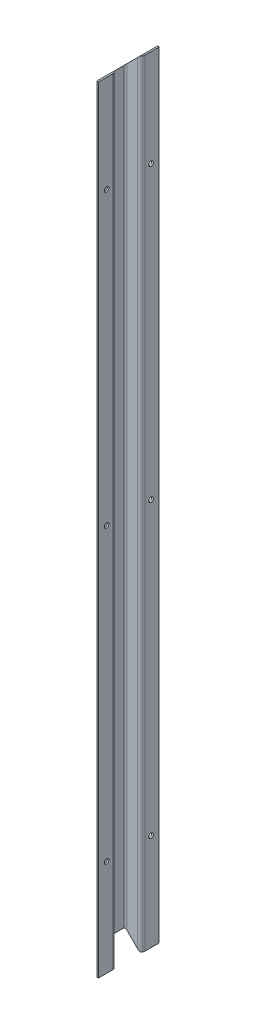
ISO-10303-21;
HEADER;
FILE_DESCRIPTION(('STEP AP214'),'2;1');
FILE_NAME('part.step','',(''),(''),'','','');
FILE_SCHEMA(('AUTOMOTIVE_DESIGN { 1 0 10303 214 1 1 1 1 }'));
ENDSEC;
DATA;
#1=APPLICATION_CONTEXT('core data for automotive mechanical design processes');
#2=APPLICATION_PROTOCOL_DEFINITION('international standard','automotive_design',2000,#1);
#3=PRODUCT_CONTEXT('',#1,'mechanical');
#4=PRODUCT('Part','Part','',(#3));
#5=PRODUCT_RELATED_PRODUCT_CATEGORY('part','',(#4));
#6=PRODUCT_DEFINITION_FORMATION('','',#4);
#7=PRODUCT_DEFINITION_CONTEXT('part definition',#1,'design');
#8=PRODUCT_DEFINITION('design','',#6,#7);
#9=PRODUCT_DEFINITION_SHAPE('','',#8);
#10=(LENGTH_UNIT() NAMED_UNIT(*) SI_UNIT(.MILLI.,.METRE.));
#11=(NAMED_UNIT(*) PLANE_ANGLE_UNIT() SI_UNIT($,.RADIAN.));
#12=(NAMED_UNIT(*) SI_UNIT($,.STERADIAN.) SOLID_ANGLE_UNIT());
#13=UNCERTAINTY_MEASURE_WITH_UNIT(LENGTH_MEASURE(1.E-05),#10,'distance_accuracy_value','');
#14=(GEOMETRIC_REPRESENTATION_CONTEXT(3) GLOBAL_UNCERTAINTY_ASSIGNED_CONTEXT((#13)) GLOBAL_UNIT_ASSIGNED_CONTEXT((#10,
#11,#12)) REPRESENTATION_CONTEXT('',''));
#15=CARTESIAN_POINT('',(0.,0.,0.));
#16=DIRECTION('',(0.,0.,1.));
#17=DIRECTION('',(1.,0.,0.));
#18=AXIS2_PLACEMENT_3D('',#15,#16,#17);
#19=CARTESIAN_POINT('',(12.7,-1219.2,-249.017002367974));
#20=DIRECTION('',(0.,0.,1.));
#21=DIRECTION('',(1.,0.,0.));
#22=AXIS2_PLACEMENT_3D('',#19,#20,#21);
#23=PLANE('',#22);
#24=DIRECTION('',(-0.707106781186548,0.707106781186548,0.));
#25=VECTOR('',#24,1.);
#26=CARTESIAN_POINT('',(12.568493857373,-1206.36849385737,-249.017002367974));
#27=LINE('',#26,#25);
#28=CARTESIAN_POINT('',(22.8092,-1216.6092,-249.017002367974));
#29=VERTEX_POINT('',#28);
#30=CARTESIAN_POINT('',(5.7658,-1199.5658,-249.017002367974));
#31=VERTEX_POINT('',#30);
#32=EDGE_CURVE('E373',#29,#31,#27,.T.);
#33=ORIENTED_EDGE('',*,*,#32,.F.);
#34=DIRECTION('',(0.,1.,0.));
#35=VECTOR('',#34,1.);
#36=CARTESIAN_POINT('',(22.8092,0.,-249.017002367974));
#37=LINE('',#36,#35);
#38=CARTESIAN_POINT('',(22.8092,-2.5908,-249.017002367974));
#39=VERTEX_POINT('',#38);
#40=EDGE_CURVE('E294',#29,#39,#37,.T.);
#41=ORIENTED_EDGE('',*,*,#40,.T.);
#42=DIRECTION('',(-0.707106781186548,-0.707106781186547,0.));
#43=VECTOR('',#42,1.);
#44=CARTESIAN_POINT('',(14.8809205779453,-10.5190794220546,-249.017002367974));
#45=LINE('',#44,#43);
#46=CARTESIAN_POINT('',(5.7658,-19.6342,-249.017002367974));
#47=VERTEX_POINT('',#46);
#48=EDGE_CURVE('E219',#39,#47,#45,.T.);
#49=ORIENTED_EDGE('',*,*,#48,.T.);
#50=DIRECTION('',(0.,1.,0.));
#51=VECTOR('',#50,1.);
#52=CARTESIAN_POINT('',(5.7658,-1219.2,-249.017002367974));
#53=LINE('',#52,#51);
#54=EDGE_CURVE('E495',#47,#31,#53,.F.);
#55=ORIENTED_EDGE('',*,*,#54,.T.);
#56=EDGE_LOOP('',(#33,#41,#49,#55));
#57=FACE_BOUND('',#56,.T.);
#58=ADVANCED_FACE('F14',(#57),#23,.T.);
#59=CARTESIAN_POINT('',(0.,-1219.2,-271.242002367973));
#60=DIRECTION('',(1.,0.,0.));
#61=DIRECTION('',(0.,0.,-1.));
#62=AXIS2_PLACEMENT_3D('',#59,#60,#61);
#63=PLANE('',#62);
#64=DIRECTION('',(0.,0.,-1.));
#65=VECTOR('',#64,1.);
#66=CARTESIAN_POINT('',(0.,-1193.8,-249.017002367974));
#67=LINE('',#66,#65);
#68=CARTESIAN_POINT('',(0.,-1193.8,-254.782802367973));
#69=VERTEX_POINT('',#68);
#70=CARTESIAN_POINT('',(0.,-1193.8,-287.701202367973));
#71=VERTEX_POINT('',#70);
#72=EDGE_CURVE('E376',#69,#71,#67,.T.);
#73=ORIENTED_EDGE('',*,*,#72,.F.);
#74=DIRECTION('',(0.,1.,0.));
#75=VECTOR('',#74,1.);
#76=CARTESIAN_POINT('',(0.,0.,-254.782802367973));
#77=LINE('',#76,#75);
#78=CARTESIAN_POINT('',(0.,-25.4,-254.782802367973));
#79=VERTEX_POINT('',#78);
#80=EDGE_CURVE('E486',#69,#79,#77,.T.);
#81=ORIENTED_EDGE('',*,*,#80,.T.);
#82=DIRECTION('',(0.,0.,-1.));
#83=VECTOR('',#82,1.);
#84=CARTESIAN_POINT('',(0.,-25.4,-249.017002367974));
#85=LINE('',#84,#83);
#86=CARTESIAN_POINT('',(0.,-25.4,-287.701202367973));
#87=VERTEX_POINT('',#86);
#88=EDGE_CURVE('E388',#79,#87,#85,.T.);
#89=ORIENTED_EDGE('',*,*,#88,.T.);
#90=DIRECTION('',(0.,1.,0.));
#91=VECTOR('',#90,1.);
#92=CARTESIAN_POINT('',(0.,-1219.2,-287.701202367973));
#93=LINE('',#92,#91);
#94=EDGE_CURVE('E229',#87,#71,#93,.F.);
#95=ORIENTED_EDGE('',*,*,#94,.T.);
#96=EDGE_LOOP('',(#73,#81,#89,#95));
#97=FACE_BOUND('',#96,.T.);
#98=ADVANCED_FACE('F537',(#97),#63,.F.);
#99=CARTESIAN_POINT('',(12.7,-1219.2,-293.467002367973));
#100=DIRECTION('',(0.,0.,1.));
#101=DIRECTION('',(1.,0.,0.));
#102=AXIS2_PLACEMENT_3D('',#99,#100,#101);
#103=PLANE('',#102);
#104=DIRECTION('',(-0.707106781186548,-0.707106781186547,0.));
#105=VECTOR('',#104,1.);
#106=CARTESIAN_POINT('',(14.8809205779453,-10.5190794220546,-293.467002367973));
#107=LINE('',#106,#105);
#108=CARTESIAN_POINT('',(22.8092,-2.5908,-293.467002367973));
#109=VERTEX_POINT('',#108);
#110=CARTESIAN_POINT('',(5.7658,-19.6342,-293.467002367973));
#111=VERTEX_POINT('',#110);
#112=EDGE_CURVE('E207',#109,#111,#107,.T.);
#113=ORIENTED_EDGE('',*,*,#112,.F.);
#114=DIRECTION('',(0.,1.,0.));
#115=VECTOR('',#114,1.);
#116=CARTESIAN_POINT('',(22.8092,-1219.2,-293.467002367973));
#117=LINE('',#116,#115);
#118=CARTESIAN_POINT('',(22.8092,-1216.6092,-293.467002367973));
#119=VERTEX_POINT('',#118);
#120=EDGE_CURVE('E277',#109,#119,#117,.F.);
#121=ORIENTED_EDGE('',*,*,#120,.T.);
#122=DIRECTION('',(-0.707106781186548,0.707106781186548,0.));
#123=VECTOR('',#122,1.);
#124=CARTESIAN_POINT('',(12.568493857373,-1206.36849385737,-293.467002367973));
#125=LINE('',#124,#123);
#126=CARTESIAN_POINT('',(5.7658,-1199.5658,-293.467002367973));
#127=VERTEX_POINT('',#126);
#128=EDGE_CURVE('E236',#119,#127,#125,.T.);
#129=ORIENTED_EDGE('',*,*,#128,.T.);
#130=DIRECTION('',(0.,1.,0.));
#131=VECTOR('',#130,1.);
#132=CARTESIAN_POINT('',(5.7658,-1219.2,-293.467002367973));
#133=LINE('',#132,#131);
#134=EDGE_CURVE('E227',#127,#111,#133,.T.);
#135=ORIENTED_EDGE('',*,*,#134,.T.);
#136=EDGE_LOOP('',(#113,#121,#129,#135));
#137=FACE_BOUND('',#136,.T.);
#138=ADVANCED_FACE('F234',(#137),#103,.F.);
#139=CARTESIAN_POINT('',(26.6954,-1219.2,-290.866042367973));
#140=DIRECTION('',(0.,0.,1.));
#141=DIRECTION('',(1.,0.,0.));
#142=AXIS2_PLACEMENT_3D('',#139,#140,#141);
#143=PLANE('',#142);
#144=DIRECTION('',(0.707106781186548,0.707106781186547,0.));
#145=VECTOR('',#144,1.);
#146=CARTESIAN_POINT('',(-583.5523,-608.9523,-290.866042367973));
#147=LINE('',#146,#145);
#148=CARTESIAN_POINT('',(5.19176,-20.20824,-290.866042367973));
#149=VERTEX_POINT('',#148);
#150=CARTESIAN_POINT('',(22.225,-3.17500000000015,-290.866042367973));
#151=VERTEX_POINT('',#150);
#152=EDGE_CURVE('E401',#149,#151,#147,.T.);
#153=ORIENTED_EDGE('',*,*,#152,.F.);
#154=DIRECTION('',(0.,1.,0.));
#155=VECTOR('',#154,1.);
#156=CARTESIAN_POINT('',(5.19176,-1196.40096,-290.866042367973));
#157=LINE('',#156,#155);
#158=CARTESIAN_POINT('',(5.19176,-1198.99176,-290.866042367973));
#159=VERTEX_POINT('',#158);
#160=EDGE_CURVE('E287',#149,#159,#157,.F.);
#161=ORIENTED_EDGE('',*,*,#160,.T.);
#162=DIRECTION('',(0.707106781186548,-0.707106781186548,0.));
#163=VECTOR('',#162,1.);
#164=CARTESIAN_POINT('',(26.0477,-1219.8477,-290.866042367973));
#165=LINE('',#164,#163);
#166=CARTESIAN_POINT('',(22.225,-1216.025,-290.866042367973));
#167=VERTEX_POINT('',#166);
#168=EDGE_CURVE('E415',#159,#167,#165,.T.);
#169=ORIENTED_EDGE('',*,*,#168,.T.);
#170=DIRECTION('',(0.,1.,0.));
#171=VECTOR('',#170,1.);
#172=CARTESIAN_POINT('',(22.225,-1219.2,-290.866042367973));
#173=LINE('',#172,#171);
#174=EDGE_CURVE('E239',#167,#151,#173,.T.);
#175=ORIENTED_EDGE('',*,*,#174,.T.);
#176=EDGE_LOOP('',(#153,#161,#169,#175));
#177=FACE_BOUND('',#176,.T.);
#178=ADVANCED_FACE('F559',(#177),#143,.T.);
#179=CARTESIAN_POINT('',(2.60096,-1219.2,-271.242002367973));
#180=DIRECTION('',(1.,0.,0.));
#181=DIRECTION('',(0.,0.,-1.));
#182=AXIS2_PLACEMENT_3D('',#179,#180,#181);
#183=PLANE('',#182);
#184=DIRECTION('',(0.,0.,-1.));
#185=VECTOR('',#184,1.);
#186=CARTESIAN_POINT('',(2.60096,-1196.40096,-271.242002367973));
#187=LINE('',#186,#185);
#188=CARTESIAN_POINT('',(2.60096,-1196.40096,-254.208762367973));
#189=VERTEX_POINT('',#188);
#190=CARTESIAN_POINT('',(2.60096,-1196.40096,-288.275242367973));
#191=VERTEX_POINT('',#190);
#192=EDGE_CURVE('E411',#189,#191,#187,.T.);
#193=ORIENTED_EDGE('',*,*,#192,.T.);
#194=DIRECTION('',(0.,1.,0.));
#195=VECTOR('',#194,1.);
#196=CARTESIAN_POINT('',(2.60096,-22.79904,-288.275242367973));
#197=LINE('',#196,#195);
#198=CARTESIAN_POINT('',(2.60096,-22.79904,-288.275242367973));
#199=VERTEX_POINT('',#198);
#200=EDGE_CURVE('E283',#191,#199,#197,.T.);
#201=ORIENTED_EDGE('',*,*,#200,.T.);
#202=DIRECTION('',(0.,0.,-1.));
#203=VECTOR('',#202,1.);
#204=CARTESIAN_POINT('',(2.60096,-22.79904,-271.242002367973));
#205=LINE('',#204,#203);
#206=CARTESIAN_POINT('',(2.60096,-22.79904,-254.208762367973));
#207=VERTEX_POINT('',#206);
#208=EDGE_CURVE('E397',#207,#199,#205,.T.);
#209=ORIENTED_EDGE('',*,*,#208,.F.);
#210=DIRECTION('',(0.,1.,0.));
#211=VECTOR('',#210,1.);
#212=CARTESIAN_POINT('',(2.60096,-1219.2,-254.208762367973));
#213=LINE('',#212,#211);
#214=EDGE_CURVE('E280',#207,#189,#213,.F.);
#215=ORIENTED_EDGE('',*,*,#214,.T.);
#216=EDGE_LOOP('',(#193,#201,#209,#215));
#217=FACE_BOUND('',#216,.T.);
#218=ADVANCED_FACE('F549',(#217),#183,.T.);
#219=CARTESIAN_POINT('',(14.00048,-1219.2,-251.617962367973));
#220=DIRECTION('',(0.,0.,1.));
#221=DIRECTION('',(1.,0.,0.));
#222=AXIS2_PLACEMENT_3D('',#219,#220,#221);
#223=PLANE('',#222);
#224=DIRECTION('',(0.707106781186548,-0.707106781186548,0.));
#225=VECTOR('',#224,1.);
#226=CARTESIAN_POINT('',(19.70024,-1213.50024,-251.617962367973));
#227=LINE('',#226,#225);
#228=CARTESIAN_POINT('',(5.19176,-1198.99176,-251.617962367973));
#229=VERTEX_POINT('',#228);
#230=CARTESIAN_POINT('',(22.225,-1216.025,-251.617962367973));
#231=VERTEX_POINT('',#230);
#232=EDGE_CURVE('E408',#229,#231,#227,.T.);
#233=ORIENTED_EDGE('',*,*,#232,.F.);
#234=DIRECTION('',(0.,1.,0.));
#235=VECTOR('',#234,1.);
#236=CARTESIAN_POINT('',(5.19176,-1219.2,-251.617962367973));
#237=LINE('',#236,#235);
#238=CARTESIAN_POINT('',(5.19175999999988,-20.20824,-251.617962367973));
#239=VERTEX_POINT('',#238);
#240=EDGE_CURVE('E290',#229,#239,#237,.T.);
#241=ORIENTED_EDGE('',*,*,#240,.T.);
#242=DIRECTION('',(0.707106781186548,0.707106781186547,0.));
#243=VECTOR('',#242,1.);
#244=CARTESIAN_POINT('',(-589.89976,-615.29976,-251.617962367973));
#245=LINE('',#244,#243);
#246=CARTESIAN_POINT('',(22.225,-3.17500000000015,-251.617962367973));
#247=VERTEX_POINT('',#246);
#248=EDGE_CURVE('E386',#239,#247,#245,.T.);
#249=ORIENTED_EDGE('',*,*,#248,.T.);
#250=DIRECTION('',(0.,1.,0.));
#251=VECTOR('',#250,1.);
#252=CARTESIAN_POINT('',(22.225,-1219.2,-251.617962367973));
#253=LINE('',#252,#251);
#254=EDGE_CURVE('E261',#247,#231,#253,.F.);
#255=ORIENTED_EDGE('',*,*,#254,.T.);
#256=EDGE_LOOP('',(#233,#241,#249,#255));
#257=FACE_BOUND('',#256,.T.);
#258=ADVANCED_FACE('F541',(#257),#223,.F.);
#259=CARTESIAN_POINT('',(13.9954,-1219.2,-271.242002367973));
#260=DIRECTION('',(0.,-1.,0.));
#261=DIRECTION('',(1.,0.,0.));
#262=AXIS2_PLACEMENT_3D('',#259,#260,#261);
#263=PLANE('',#262);
#264=DIRECTION('',(0.,0.,1.));
#265=VECTOR('',#264,1.);
#266=CARTESIAN_POINT('',(25.4,-1219.2,-236.317002367974));
#267=LINE('',#266,#265);
#268=CARTESIAN_POINT('',(25.4,-1219.2,-246.426202367974));
#269=VERTEX_POINT('',#268);
#270=CARTESIAN_POINT('',(25.4,-1219.2,-223.617002367974));
#271=VERTEX_POINT('',#270);
#272=EDGE_CURVE('E448',#269,#271,#267,.T.);
#273=ORIENTED_EDGE('',*,*,#272,.F.);
#274=DIRECTION('',(0.,0.,-1.));
#275=VECTOR('',#274,1.);
#276=CARTESIAN_POINT('',(25.4,-1219.2,-249.017002367974));
#277=LINE('',#276,#275);
#278=CARTESIAN_POINT('',(25.4,-1219.2,-250.665043484311));
#279=VERTEX_POINT('',#278);
#280=EDGE_CURVE('E382',#269,#279,#277,.T.);
#281=ORIENTED_EDGE('',*,*,#280,.T.);
#282=CARTESIAN_POINT('',(22.225,-1219.2,-245.852162367974));
#283=DIRECTION('',(0.,-1.,0.));
#284=DIRECTION('',(0.,0.,-1.));
#285=AXIS2_PLACEMENT_3D('',#282,#283,#284);
#286=CIRCLE('',#285,5.7658);
#287=CARTESIAN_POINT('',(27.9908,-1219.2,-245.852162367974));
#288=VERTEX_POINT('',#287);
#289=EDGE_CURVE('E251',#279,#288,#286,.T.);
#290=ORIENTED_EDGE('',*,*,#289,.T.);
#291=DIRECTION('',(0.,0.,-1.));
#292=VECTOR('',#291,1.);
#293=CARTESIAN_POINT('',(27.9908,-1219.2,-250.317482367973));
#294=LINE('',#293,#292);
#295=CARTESIAN_POINT('',(27.9908,-1219.2,-223.617002367974));
#296=VERTEX_POINT('',#295);
#297=EDGE_CURVE('E440',#296,#288,#294,.T.);
#298=ORIENTED_EDGE('',*,*,#297,.F.);
#299=DIRECTION('',(1.,0.,0.));
#300=VECTOR('',#299,1.);
#301=CARTESIAN_POINT('',(26.6954,-1219.2,-223.617002367974));
#302=LINE('',#301,#300);
#303=EDGE_CURVE('E444',#271,#296,#302,.T.);
#304=ORIENTED_EDGE('',*,*,#303,.F.);
#305=EDGE_LOOP('',(#273,#281,#290,#298,#304));
#306=FACE_BOUND('',#305,.T.);
#307=ADVANCED_FACE('F504',(#306),#263,.T.);
#308=CARTESIAN_POINT('',(22.225,-1219.2,-296.631842367973));
#309=DIRECTION('',(0.,-1.,0.));
#310=DIRECTION('',(0.,0.,-1.));
#311=AXIS2_PLACEMENT_3D('',#308,#309,#310);
#312=CIRCLE('',#311,5.7658);
#313=CARTESIAN_POINT('',(27.9908,-1219.2,-296.631842367973));
#314=VERTEX_POINT('',#313);
#315=CARTESIAN_POINT('',(25.4,-1219.2,-291.818961251635));
#316=VERTEX_POINT('',#315);
#317=EDGE_CURVE('E240',#314,#316,#312,.T.);
#318=ORIENTED_EDGE('',*,*,#317,.T.);
#319=CARTESIAN_POINT('',(25.4,-1219.2,-296.057802367973));
#320=VERTEX_POINT('',#319);
#321=EDGE_CURVE('E381',#316,#320,#277,.T.);
#322=ORIENTED_EDGE('',*,*,#321,.T.);
#323=DIRECTION('',(0.,0.,-1.));
#324=VECTOR('',#323,1.);
#325=CARTESIAN_POINT('',(25.4,-1219.2,-306.167002367974));
#326=LINE('',#325,#324);
#327=CARTESIAN_POINT('',(25.4,-1219.2,-318.867002367973));
#328=VERTEX_POINT('',#327);
#329=EDGE_CURVE('E429',#320,#328,#326,.T.);
#330=ORIENTED_EDGE('',*,*,#329,.T.);
#331=DIRECTION('',(1.,0.,0.));
#332=VECTOR('',#331,1.);
#333=CARTESIAN_POINT('',(26.6954,-1219.2,-318.867002367973));
#334=LINE('',#333,#332);
#335=CARTESIAN_POINT('',(27.9908,-1219.2,-318.867002367973));
#336=VERTEX_POINT('',#335);
#337=EDGE_CURVE('E432',#328,#336,#334,.T.);
#338=ORIENTED_EDGE('',*,*,#337,.T.);
#339=DIRECTION('',(0.,0.,-1.));
#340=VECTOR('',#339,1.);
#341=CARTESIAN_POINT('',(27.9908,-1219.2,-306.167002367974));
#342=LINE('',#341,#340);
#343=EDGE_CURVE('E437',#314,#336,#342,.T.);
#344=ORIENTED_EDGE('',*,*,#343,.F.);
#345=EDGE_LOOP('',(#318,#322,#330,#338,#344));
#346=FACE_BOUND('',#345,.T.);
#347=ADVANCED_FACE('F682',(#346),#263,.T.);
#348=CARTESIAN_POINT('',(13.9954,0.,-271.242002367973));
#349=DIRECTION('',(0.,-1.,0.));
#350=DIRECTION('',(1.,0.,0.));
#351=AXIS2_PLACEMENT_3D('',#348,#349,#350);
#352=PLANE('',#351);
#353=DIRECTION('',(0.,0.,-1.));
#354=VECTOR('',#353,1.);
#355=CARTESIAN_POINT('',(25.4,0.,-249.017002367974));
#356=LINE('',#355,#354);
#357=CARTESIAN_POINT('',(25.4,0.,-246.426202367974));
#358=VERTEX_POINT('',#357);
#359=CARTESIAN_POINT('',(25.4,0.,-250.665043484311));
#360=VERTEX_POINT('',#359);
#361=EDGE_CURVE('E38',#358,#360,#356,.T.);
#362=ORIENTED_EDGE('',*,*,#361,.F.);
#363=DIRECTION('',(0.,0.,1.));
#364=VECTOR('',#363,1.);
#365=CARTESIAN_POINT('',(25.4,0.,-236.317002367974));
#366=LINE('',#365,#364);
#367=CARTESIAN_POINT('',(25.4,0.,-223.617002367974));
#368=VERTEX_POINT('',#367);
#369=EDGE_CURVE('E433',#358,#368,#366,.T.);
#370=ORIENTED_EDGE('',*,*,#369,.T.);
#371=DIRECTION('',(1.,0.,0.));
#372=VECTOR('',#371,1.);
#373=CARTESIAN_POINT('',(26.6954,0.,-223.617002367974));
#374=LINE('',#373,#372);
#375=CARTESIAN_POINT('',(27.9908,0.,-223.617002367974));
#376=VERTEX_POINT('',#375);
#377=EDGE_CURVE('E465',#368,#376,#374,.T.);
#378=ORIENTED_EDGE('',*,*,#377,.T.);
#379=DIRECTION('',(0.,0.,-1.));
#380=VECTOR('',#379,1.);
#381=CARTESIAN_POINT('',(27.9908,0.,-250.317482367973));
#382=LINE('',#381,#380);
#383=CARTESIAN_POINT('',(27.9908,0.,-245.852162367974));
#384=VERTEX_POINT('',#383);
#385=EDGE_CURVE('E461',#376,#384,#382,.T.);
#386=ORIENTED_EDGE('',*,*,#385,.T.);
#387=CARTESIAN_POINT('',(22.225,0.,-245.852162367974));
#388=DIRECTION('',(0.,-1.,0.));
#389=DIRECTION('',(0.,0.,-1.));
#390=AXIS2_PLACEMENT_3D('',#387,#388,#389);
#391=CIRCLE('',#390,5.7658);
#392=EDGE_CURVE('E489',#384,#360,#391,.F.);
#393=ORIENTED_EDGE('',*,*,#392,.T.);
#394=EDGE_LOOP('',(#362,#370,#378,#386,#393));
#395=FACE_BOUND('',#394,.T.);
#396=ADVANCED_FACE('F515',(#395),#352,.F.);
#397=CARTESIAN_POINT('',(25.4,0.,-291.818961251635));
#398=VERTEX_POINT('',#397);
#399=CARTESIAN_POINT('',(25.4,0.,-296.057802367973));
#400=VERTEX_POINT('',#399);
#401=EDGE_CURVE('E392',#398,#400,#356,.T.);
#402=ORIENTED_EDGE('',*,*,#401,.F.);
#403=CARTESIAN_POINT('',(22.225,0.,-296.631842367973));
#404=DIRECTION('',(0.,-1.,0.));
#405=DIRECTION('',(0.,0.,-1.));
#406=AXIS2_PLACEMENT_3D('',#403,#404,#405);
#407=CIRCLE('',#406,5.7658);
#408=CARTESIAN_POINT('',(27.9908,0.,-296.631842367973));
#409=VERTEX_POINT('',#408);
#410=EDGE_CURVE('E492',#398,#409,#407,.F.);
#411=ORIENTED_EDGE('',*,*,#410,.T.);
#412=DIRECTION('',(0.,0.,-1.));
#413=VECTOR('',#412,1.);
#414=CARTESIAN_POINT('',(27.9908,0.,-306.167002367974));
#415=LINE('',#414,#413);
#416=CARTESIAN_POINT('',(27.9908,0.,-318.867002367973));
#417=VERTEX_POINT('',#416);
#418=EDGE_CURVE('E458',#409,#417,#415,.T.);
#419=ORIENTED_EDGE('',*,*,#418,.T.);
#420=DIRECTION('',(1.,0.,0.));
#421=VECTOR('',#420,1.);
#422=CARTESIAN_POINT('',(26.6954,0.,-318.867002367973));
#423=LINE('',#422,#421);
#424=CARTESIAN_POINT('',(25.4,0.,-318.867002367973));
#425=VERTEX_POINT('',#424);
#426=EDGE_CURVE('E454',#425,#417,#423,.T.);
#427=ORIENTED_EDGE('',*,*,#426,.F.);
#428=DIRECTION('',(0.,0.,-1.));
#429=VECTOR('',#428,1.);
#430=CARTESIAN_POINT('',(25.4,0.,-306.167002367974));
#431=LINE('',#430,#429);
#432=EDGE_CURVE('E428',#400,#425,#431,.T.);
#433=ORIENTED_EDGE('',*,*,#432,.F.);
#434=EDGE_LOOP('',(#402,#411,#419,#427,#433));
#435=FACE_BOUND('',#434,.T.);
#436=ADVANCED_FACE('F571',(#435),#352,.F.);
#437=CARTESIAN_POINT('',(5.7658,-1219.2,-254.782802367973));
#438=DIRECTION('',(0.,-1.,0.));
#439=DIRECTION('',(0.,0.,-1.));
#440=AXIS2_PLACEMENT_3D('',#437,#438,#439);
#441=CYLINDRICAL_SURFACE('',#440,5.7658);
#442=ORIENTED_EDGE('',*,*,#80,.F.);
#443=CARTESIAN_POINT('',(5.7658,-1199.5658,-254.782802367973));
#444=DIRECTION('',(-0.707106781186548,-0.707106781186547,0.));
#445=DIRECTION('',(0.707106781186547,-0.707106781186548,0.));
#446=AXIS2_PLACEMENT_3D('',#443,#444,#445);
#447=ELLIPSE('',#446,8.1540725579308,5.7658);
#448=EDGE_CURVE('E424',#69,#31,#447,.F.);
#449=ORIENTED_EDGE('',*,*,#448,.T.);
#450=ORIENTED_EDGE('',*,*,#54,.F.);
#451=CARTESIAN_POINT('',(5.7658,-19.6342,-254.782802367973));
#452=DIRECTION('',(0.707106781186547,-0.707106781186548,0.));
#453=DIRECTION('',(-0.707106781186548,-0.707106781186547,0.));
#454=AXIS2_PLACEMENT_3D('',#451,#452,#453);
#455=ELLIPSE('',#454,8.15407255793079,5.7658);
#456=EDGE_CURVE('E231',#79,#47,#455,.F.);
#457=ORIENTED_EDGE('',*,*,#456,.F.);
#458=EDGE_LOOP('',(#442,#449,#450,#457));
#459=FACE_BOUND('',#458,.T.);
#460=ADVANCED_FACE('F534',(#459),#441,.T.);
#461=CARTESIAN_POINT('',(5.7658,-1219.2,-287.701202367973));
#462=DIRECTION('',(0.,1.,0.));
#463=DIRECTION('',(0.,0.,1.));
#464=AXIS2_PLACEMENT_3D('',#461,#462,#463);
#465=CYLINDRICAL_SURFACE('',#464,5.7658);
#466=ORIENTED_EDGE('',*,*,#134,.F.);
#467=CARTESIAN_POINT('',(5.7658,-1199.5658,-287.701202367973));
#468=DIRECTION('',(-0.707106781186548,-0.707106781186547,0.));
#469=DIRECTION('',(-0.707106781186547,0.707106781186548,0.));
#470=AXIS2_PLACEMENT_3D('',#467,#468,#469);
#471=ELLIPSE('',#470,8.1540725579308,5.7658);
#472=EDGE_CURVE('E421',#127,#71,#471,.F.);
#473=ORIENTED_EDGE('',*,*,#472,.T.);
#474=ORIENTED_EDGE('',*,*,#94,.F.);
#475=CARTESIAN_POINT('',(5.7658,-19.6342,-287.701202367973));
#476=DIRECTION('',(0.707106781186547,-0.707106781186548,0.));
#477=DIRECTION('',(0.707106781186548,0.707106781186547,0.));
#478=AXIS2_PLACEMENT_3D('',#475,#476,#477);
#479=ELLIPSE('',#478,8.15407255793079,5.7658);
#480=EDGE_CURVE('E211',#111,#87,#479,.F.);
#481=ORIENTED_EDGE('',*,*,#480,.F.);
#482=EDGE_LOOP('',(#466,#473,#474,#481));
#483=FACE_BOUND('',#482,.T.);
#484=ADVANCED_FACE('F225',(#483),#465,.T.);
#485=CARTESIAN_POINT('',(22.225,-1219.2,-296.631842367973));
#486=DIRECTION('',(0.,1.,0.));
#487=DIRECTION('',(0.,0.,1.));
#488=AXIS2_PLACEMENT_3D('',#485,#486,#487);
#489=CYLINDRICAL_SURFACE('',#488,5.7658);
#490=ORIENTED_EDGE('',*,*,#174,.F.);
#491=CARTESIAN_POINT('',(22.225,-1216.025,-296.631842367973));
#492=DIRECTION('',(-0.707106781186548,-0.707106781186547,0.));
#493=DIRECTION('',(-0.707106781186547,0.707106781186548,0.));
#494=AXIS2_PLACEMENT_3D('',#491,#492,#493);
#495=ELLIPSE('',#494,8.1540725579308,5.7658);
#496=EDGE_CURVE('E418',#167,#316,#495,.F.);
#497=ORIENTED_EDGE('',*,*,#496,.T.);
#498=ORIENTED_EDGE('',*,*,#317,.F.);
#499=DIRECTION('',(0.,1.,0.));
#500=VECTOR('',#499,1.);
#501=CARTESIAN_POINT('',(27.9908,-1219.2,-296.631842367973));
#502=LINE('',#501,#500);
#503=EDGE_CURVE('E247',#409,#314,#502,.F.);
#504=ORIENTED_EDGE('',*,*,#503,.F.);
#505=ORIENTED_EDGE('',*,*,#410,.F.);
#506=CARTESIAN_POINT('',(22.225,-3.17500000000015,-296.631842367973));
#507=DIRECTION('',(0.707106781186547,-0.707106781186548,0.));
#508=DIRECTION('',(0.707106781186548,0.707106781186547,0.));
#509=AXIS2_PLACEMENT_3D('',#506,#507,#508);
#510=ELLIPSE('',#509,8.15407255793079,5.7658);
#511=EDGE_CURVE('E232',#151,#398,#510,.F.);
#512=ORIENTED_EDGE('',*,*,#511,.F.);
#513=EDGE_LOOP('',(#490,#497,#498,#504,#505,#512));
#514=FACE_BOUND('',#513,.T.);
#515=ADVANCED_FACE('F564',(#514),#489,.T.);
#516=CARTESIAN_POINT('',(22.225,-1219.2,-245.852162367974));
#517=DIRECTION('',(0.,-1.,0.));
#518=DIRECTION('',(0.,0.,-1.));
#519=AXIS2_PLACEMENT_3D('',#516,#517,#518);
#520=CYLINDRICAL_SURFACE('',#519,5.7658);
#521=ORIENTED_EDGE('',*,*,#289,.F.);
#522=CARTESIAN_POINT('',(22.225,-1216.025,-245.852162367974));
#523=DIRECTION('',(-0.707106781186548,-0.707106781186547,0.));
#524=DIRECTION('',(0.707106781186547,-0.707106781186548,0.));
#525=AXIS2_PLACEMENT_3D('',#522,#523,#524);
#526=ELLIPSE('',#525,8.1540725579308,5.7658);
#527=EDGE_CURVE('E269',#279,#231,#526,.F.);
#528=ORIENTED_EDGE('',*,*,#527,.T.);
#529=ORIENTED_EDGE('',*,*,#254,.F.);
#530=CARTESIAN_POINT('',(22.225,-3.17500000000015,-245.852162367974));
#531=DIRECTION('',(0.707106781186547,-0.707106781186548,0.));
#532=DIRECTION('',(-0.707106781186548,-0.707106781186547,0.));
#533=AXIS2_PLACEMENT_3D('',#530,#531,#532);
#534=ELLIPSE('',#533,8.15407255793079,5.7658);
#535=EDGE_CURVE('E265',#360,#247,#534,.F.);
#536=ORIENTED_EDGE('',*,*,#535,.F.);
#537=ORIENTED_EDGE('',*,*,#392,.F.);
#538=DIRECTION('',(0.,1.,0.));
#539=VECTOR('',#538,1.);
#540=CARTESIAN_POINT('',(27.9908,0.,-245.852162367974));
#541=LINE('',#540,#539);
#542=EDGE_CURVE('E257',#288,#384,#541,.T.);
#543=ORIENTED_EDGE('',*,*,#542,.F.);
#544=EDGE_LOOP('',(#521,#528,#529,#536,#537,#543));
#545=FACE_BOUND('',#544,.T.);
#546=ADVANCED_FACE('F512',(#545),#520,.T.);
#547=CARTESIAN_POINT('',(25.4,-1219.2,-306.167002367974));
#548=DIRECTION('',(1.,0.,0.));
#549=DIRECTION('',(0.,0.,-1.));
#550=AXIS2_PLACEMENT_3D('',#547,#548,#549);
#551=PLANE('',#550);
#552=CARTESIAN_POINT('',(25.4,-152.4,-306.167002367974));
#553=DIRECTION('',(1.,0.,0.));
#554=DIRECTION('',(0.,0.,-1.));
#555=AXIS2_PLACEMENT_3D('',#552,#553,#554);
#556=CIRCLE('',#555,3.683);
#557=CARTESIAN_POINT('',(25.4,-152.4,-309.850002367974));
#558=VERTEX_POINT('',#557);
#559=EDGE_CURVE('E18',#558,#558,#556,.F.);
#560=ORIENTED_EDGE('',*,*,#559,.F.);
#561=EDGE_LOOP('',(#560));
#562=FACE_BOUND('',#561,.T.);
#563=CARTESIAN_POINT('',(25.4,-1066.8,-306.167002367974));
#564=DIRECTION('',(1.,0.,0.));
#565=DIRECTION('',(0.,0.,-1.));
#566=AXIS2_PLACEMENT_3D('',#563,#564,#565);
#567=CIRCLE('',#566,3.683);
#568=CARTESIAN_POINT('',(25.4,-1066.8,-309.850002367974));
#569=VERTEX_POINT('',#568);
#570=EDGE_CURVE('E337',#569,#569,#567,.F.);
#571=ORIENTED_EDGE('',*,*,#570,.F.);
#572=EDGE_LOOP('',(#571));
#573=FACE_BOUND('',#572,.T.);
#574=CARTESIAN_POINT('',(25.4,-609.6,-306.167002367974));
#575=DIRECTION('',(1.,0.,0.));
#576=DIRECTION('',(0.,0.,-1.));
#577=AXIS2_PLACEMENT_3D('',#574,#575,#576);
#578=CIRCLE('',#577,3.683);
#579=CARTESIAN_POINT('',(25.4,-609.6,-309.850002367974));
#580=VERTEX_POINT('',#579);
#581=EDGE_CURVE('E327',#580,#580,#578,.F.);
#582=ORIENTED_EDGE('',*,*,#581,.F.);
#583=EDGE_LOOP('',(#582));
#584=FACE_BOUND('',#583,.T.);
#585=ORIENTED_EDGE('',*,*,#329,.F.);
#586=DIRECTION('',(0.,1.,0.));
#587=VECTOR('',#586,1.);
#588=CARTESIAN_POINT('',(25.4,0.,-296.057802367973));
#589=LINE('',#588,#587);
#590=EDGE_CURVE('E273',#320,#400,#589,.T.);
#591=ORIENTED_EDGE('',*,*,#590,.T.);
#592=ORIENTED_EDGE('',*,*,#432,.T.);
#593=DIRECTION('',(0.,1.,0.));
#594=VECTOR('',#593,1.);
#595=CARTESIAN_POINT('',(25.4,-1219.2,-318.867002367973));
#596=LINE('',#595,#594);
#597=EDGE_CURVE('E481',#328,#425,#596,.T.);
#598=ORIENTED_EDGE('',*,*,#597,.F.);
#599=EDGE_LOOP('',(#585,#591,#592,#598));
#600=FACE_BOUND('',#599,.T.);
#601=ADVANCED_FACE('F838',(#562,#573,#584,#600),#551,.F.);
#602=CARTESIAN_POINT('',(26.6954,-1219.2,-318.867002367973));
#603=DIRECTION('',(0.,0.,1.));
#604=DIRECTION('',(1.,0.,0.));
#605=AXIS2_PLACEMENT_3D('',#602,#603,#604);
#606=PLANE('',#605);
#607=ORIENTED_EDGE('',*,*,#426,.T.);
#608=DIRECTION('',(0.,1.,0.));
#609=VECTOR('',#608,1.);
#610=CARTESIAN_POINT('',(27.9908,-1219.2,-318.867002367973));
#611=LINE('',#610,#609);
#612=EDGE_CURVE('E477',#336,#417,#611,.T.);
#613=ORIENTED_EDGE('',*,*,#612,.F.);
#614=ORIENTED_EDGE('',*,*,#337,.F.);
#615=ORIENTED_EDGE('',*,*,#597,.T.);
#616=EDGE_LOOP('',(#607,#613,#614,#615));
#617=FACE_BOUND('',#616,.T.);
#618=ADVANCED_FACE('F830',(#617),#606,.F.);
#619=CARTESIAN_POINT('',(27.9908,-1219.2,-306.167002367974));
#620=DIRECTION('',(1.,0.,0.));
#621=DIRECTION('',(0.,0.,-1.));
#622=AXIS2_PLACEMENT_3D('',#619,#620,#621);
#623=PLANE('',#622);
#624=CARTESIAN_POINT('',(27.9908,-152.4,-306.167002367974));
#625=DIRECTION('',(1.,0.,0.));
#626=DIRECTION('',(0.,0.,-1.));
#627=AXIS2_PLACEMENT_3D('',#624,#625,#626);
#628=CIRCLE('',#627,3.683);
#629=CARTESIAN_POINT('',(27.9908,-152.4,-309.850002367974));
#630=VERTEX_POINT('',#629);
#631=EDGE_CURVE('E361',#630,#630,#628,.T.);
#632=ORIENTED_EDGE('',*,*,#631,.F.);
#633=EDGE_LOOP('',(#632));
#634=FACE_BOUND('',#633,.T.);
#635=CARTESIAN_POINT('',(27.9908,-1066.8,-306.167002367974));
#636=DIRECTION('',(1.,0.,0.));
#637=DIRECTION('',(0.,0.,-1.));
#638=AXIS2_PLACEMENT_3D('',#635,#636,#637);
#639=CIRCLE('',#638,3.683);
#640=CARTESIAN_POINT('',(27.9908,-1066.8,-309.850002367974));
#641=VERTEX_POINT('',#640);
#642=EDGE_CURVE('E340',#641,#641,#639,.T.);
#643=ORIENTED_EDGE('',*,*,#642,.F.);
#644=EDGE_LOOP('',(#643));
#645=FACE_BOUND('',#644,.T.);
#646=CARTESIAN_POINT('',(27.9908,-609.6,-306.167002367974));
#647=DIRECTION('',(1.,0.,0.));
#648=DIRECTION('',(0.,0.,-1.));
#649=AXIS2_PLACEMENT_3D('',#646,#647,#648);
#650=CIRCLE('',#649,3.683);
#651=CARTESIAN_POINT('',(27.9908,-609.6,-309.850002367974));
#652=VERTEX_POINT('',#651);
#653=EDGE_CURVE('E331',#652,#652,#650,.T.);
#654=ORIENTED_EDGE('',*,*,#653,.F.);
#655=EDGE_LOOP('',(#654));
#656=FACE_BOUND('',#655,.T.);
#657=ORIENTED_EDGE('',*,*,#418,.F.);
#658=ORIENTED_EDGE('',*,*,#503,.T.);
#659=ORIENTED_EDGE('',*,*,#343,.T.);
#660=ORIENTED_EDGE('',*,*,#612,.T.);
#661=EDGE_LOOP('',(#657,#658,#659,#660));
#662=FACE_BOUND('',#661,.T.);
#663=ADVANCED_FACE('F822',(#634,#645,#656,#662),#623,.T.);
#664=CARTESIAN_POINT('',(27.9908,-1219.2,-250.317482367973));
#665=DIRECTION('',(1.,0.,0.));
#666=DIRECTION('',(0.,0.,-1.));
#667=AXIS2_PLACEMENT_3D('',#664,#665,#666);
#668=PLANE('',#667);
#669=CARTESIAN_POINT('',(27.9908,-152.4,-236.317002367974));
#670=DIRECTION('',(1.,0.,0.));
#671=DIRECTION('',(0.,0.,-1.));
#672=AXIS2_PLACEMENT_3D('',#669,#670,#671);
#673=CIRCLE('',#672,3.683);
#674=CARTESIAN_POINT('',(27.9908,-152.4,-240.000002367974));
#675=VERTEX_POINT('',#674);
#676=EDGE_CURVE('E344',#675,#675,#673,.T.);
#677=ORIENTED_EDGE('',*,*,#676,.F.);
#678=EDGE_LOOP('',(#677));
#679=FACE_BOUND('',#678,.T.);
#680=CARTESIAN_POINT('',(27.9908,-1066.8,-236.317002367974));
#681=DIRECTION('',(1.,0.,0.));
#682=DIRECTION('',(0.,0.,-1.));
#683=AXIS2_PLACEMENT_3D('',#680,#681,#682);
#684=CIRCLE('',#683,3.683);
#685=CARTESIAN_POINT('',(27.9908,-1066.8,-240.000002367974));
#686=VERTEX_POINT('',#685);
#687=EDGE_CURVE('E336',#686,#686,#684,.T.);
#688=ORIENTED_EDGE('',*,*,#687,.F.);
#689=EDGE_LOOP('',(#688));
#690=FACE_BOUND('',#689,.T.);
#691=CARTESIAN_POINT('',(27.9908,-609.6,-236.317002367974));
#692=DIRECTION('',(1.,0.,0.));
#693=DIRECTION('',(0.,0.,-1.));
#694=AXIS2_PLACEMENT_3D('',#691,#692,#693);
#695=CIRCLE('',#694,3.683);
#696=CARTESIAN_POINT('',(27.9908,-609.6,-240.000002367974));
#697=VERTEX_POINT('',#696);
#698=EDGE_CURVE('E326',#697,#697,#695,.T.);
#699=ORIENTED_EDGE('',*,*,#698,.F.);
#700=EDGE_LOOP('',(#699));
#701=FACE_BOUND('',#700,.T.);
#702=ORIENTED_EDGE('',*,*,#297,.T.);
#703=ORIENTED_EDGE('',*,*,#542,.T.);
#704=ORIENTED_EDGE('',*,*,#385,.F.);
#705=DIRECTION('',(0.,1.,0.));
#706=VECTOR('',#705,1.);
#707=CARTESIAN_POINT('',(27.9908,-1219.2,-223.617002367974));
#708=LINE('',#707,#706);
#709=EDGE_CURVE('E474',#296,#376,#708,.T.);
#710=ORIENTED_EDGE('',*,*,#709,.F.);
#711=EDGE_LOOP('',(#702,#703,#704,#710));
#712=FACE_BOUND('',#711,.T.);
#713=ADVANCED_FACE('F510',(#679,#690,#701,#712),#668,.T.);
#714=CARTESIAN_POINT('',(26.6954,-1219.2,-223.617002367974));
#715=DIRECTION('',(0.,0.,1.));
#716=DIRECTION('',(1.,0.,0.));
#717=AXIS2_PLACEMENT_3D('',#714,#715,#716);
#718=PLANE('',#717);
#719=ORIENTED_EDGE('',*,*,#377,.F.);
#720=DIRECTION('',(0.,1.,0.));
#721=VECTOR('',#720,1.);
#722=CARTESIAN_POINT('',(25.4,-1219.2,-223.617002367974));
#723=LINE('',#722,#721);
#724=EDGE_CURVE('E451',#271,#368,#723,.T.);
#725=ORIENTED_EDGE('',*,*,#724,.F.);
#726=ORIENTED_EDGE('',*,*,#303,.T.);
#727=ORIENTED_EDGE('',*,*,#709,.T.);
#728=EDGE_LOOP('',(#719,#725,#726,#727));
#729=FACE_BOUND('',#728,.T.);
#730=ADVANCED_FACE('F519',(#729),#718,.T.);
#731=CARTESIAN_POINT('',(25.4,-1219.2,-236.317002367974));
#732=DIRECTION('',(-1.,0.,0.));
#733=DIRECTION('',(0.,0.,1.));
#734=AXIS2_PLACEMENT_3D('',#731,#732,#733);
#735=PLANE('',#734);
#736=CARTESIAN_POINT('',(25.4,-152.4,-236.317002367974));
#737=DIRECTION('',(-1.,0.,0.));
#738=DIRECTION('',(0.,0.,1.));
#739=AXIS2_PLACEMENT_3D('',#736,#737,#738);
#740=CIRCLE('',#739,3.683);
#741=CARTESIAN_POINT('',(25.4,-152.4,-232.634002367974));
#742=VERTEX_POINT('',#741);
#743=EDGE_CURVE('E341',#742,#742,#740,.F.);
#744=ORIENTED_EDGE('',*,*,#743,.T.);
#745=EDGE_LOOP('',(#744));
#746=FACE_BOUND('',#745,.T.);
#747=CARTESIAN_POINT('',(25.4,-1066.8,-236.317002367974));
#748=DIRECTION('',(-1.,0.,0.));
#749=DIRECTION('',(0.,0.,1.));
#750=AXIS2_PLACEMENT_3D('',#747,#748,#749);
#751=CIRCLE('',#750,3.683);
#752=CARTESIAN_POINT('',(25.4,-1066.8,-232.634002367974));
#753=VERTEX_POINT('',#752);
#754=EDGE_CURVE('E332',#753,#753,#751,.F.);
#755=ORIENTED_EDGE('',*,*,#754,.T.);
#756=EDGE_LOOP('',(#755));
#757=FACE_BOUND('',#756,.T.);
#758=CARTESIAN_POINT('',(25.4,-609.6,-236.317002367974));
#759=DIRECTION('',(-1.,0.,0.));
#760=DIRECTION('',(0.,0.,1.));
#761=AXIS2_PLACEMENT_3D('',#758,#759,#760);
#762=CIRCLE('',#761,3.683);
#763=CARTESIAN_POINT('',(25.4,-609.6,-232.634002367974));
#764=VERTEX_POINT('',#763);
#765=EDGE_CURVE('E220',#764,#764,#762,.F.);
#766=ORIENTED_EDGE('',*,*,#765,.T.);
#767=EDGE_LOOP('',(#766));
#768=FACE_BOUND('',#767,.T.);
#769=ORIENTED_EDGE('',*,*,#369,.F.);
#770=DIRECTION('',(0.,1.,0.));
#771=VECTOR('',#770,1.);
#772=CARTESIAN_POINT('',(25.4,-1219.2,-246.426202367974));
#773=LINE('',#772,#771);
#774=EDGE_CURVE('E298',#358,#269,#773,.F.);
#775=ORIENTED_EDGE('',*,*,#774,.T.);
#776=ORIENTED_EDGE('',*,*,#272,.T.);
#777=ORIENTED_EDGE('',*,*,#724,.T.);
#778=EDGE_LOOP('',(#769,#775,#776,#777));
#779=FACE_BOUND('',#778,.T.);
#780=ADVANCED_FACE('F623',(#746,#757,#768,#779),#735,.T.);
#781=CARTESIAN_POINT('',(14.8809205779453,-10.5190794220546,-249.017002367974));
#782=DIRECTION('',(0.707106781186547,-0.707106781186548,0.));
#783=DIRECTION('',(0.707106781186548,0.707106781186547,0.));
#784=AXIS2_PLACEMENT_3D('',#781,#782,#783);
#785=PLANE('',#784);
#786=ORIENTED_EDGE('',*,*,#456,.T.);
#787=ORIENTED_EDGE('',*,*,#48,.F.);
#788=CARTESIAN_POINT('',(22.8092,-2.59080000000011,-246.426202367974));
#789=DIRECTION('',(0.707106781186547,-0.707106781186548,0.));
#790=DIRECTION('',(-0.707106781186548,-0.707106781186547,0.));
#791=AXIS2_PLACEMENT_3D('',#788,#789,#790);
#792=ELLIPSE('',#791,3.66394449739622,2.5908);
#793=EDGE_CURVE('E25',#39,#358,#792,.T.);
#794=ORIENTED_EDGE('',*,*,#793,.T.);
#795=ORIENTED_EDGE('',*,*,#361,.T.);
#796=ORIENTED_EDGE('',*,*,#535,.T.);
#797=ORIENTED_EDGE('',*,*,#248,.F.);
#798=CARTESIAN_POINT('',(5.19176,-20.20824,-254.208762367973));
#799=DIRECTION('',(0.707106781186547,-0.707106781186548,0.));
#800=DIRECTION('',(0.707106781186548,0.707106781186547,0.));
#801=AXIS2_PLACEMENT_3D('',#798,#799,#800);
#802=ELLIPSE('',#801,3.66394449739622,2.5908);
#803=EDGE_CURVE('E314',#239,#207,#802,.T.);
#804=ORIENTED_EDGE('',*,*,#803,.T.);
#805=ORIENTED_EDGE('',*,*,#208,.T.);
#806=CARTESIAN_POINT('',(5.19176,-20.20824,-288.275242367973));
#807=DIRECTION('',(0.707106781186547,-0.707106781186548,0.));
#808=DIRECTION('',(-0.707106781186548,-0.707106781186547,0.));
#809=AXIS2_PLACEMENT_3D('',#806,#807,#808);
#810=ELLIPSE('',#809,3.66394449739622,2.5908);
#811=EDGE_CURVE('E308',#199,#149,#810,.T.);
#812=ORIENTED_EDGE('',*,*,#811,.T.);
#813=ORIENTED_EDGE('',*,*,#152,.T.);
#814=ORIENTED_EDGE('',*,*,#511,.T.);
#815=ORIENTED_EDGE('',*,*,#401,.T.);
#816=CARTESIAN_POINT('',(22.8092,-2.59080000000011,-296.057802367973));
#817=DIRECTION('',(0.707106781186547,-0.707106781186548,0.));
#818=DIRECTION('',(-0.707106781186548,-0.707106781186547,0.));
#819=AXIS2_PLACEMENT_3D('',#816,#817,#818);
#820=ELLIPSE('',#819,3.66394449739622,2.5908);
#821=EDGE_CURVE('E214',#400,#109,#820,.T.);
#822=ORIENTED_EDGE('',*,*,#821,.T.);
#823=ORIENTED_EDGE('',*,*,#112,.T.);
#824=ORIENTED_EDGE('',*,*,#480,.T.);
#825=ORIENTED_EDGE('',*,*,#88,.F.);
#826=EDGE_LOOP('',(#786,#787,#794,#795,#796,#797,#804,#805,#812,#813,#814,#815,#822,#823,#824,#825));
#827=FACE_BOUND('',#826,.T.);
#828=ADVANCED_FACE('F210',(#827),#785,.F.);
#829=CARTESIAN_POINT('',(12.568493857373,-1206.36849385737,-249.017002367974));
#830=DIRECTION('',(-0.707106781186548,-0.707106781186547,0.));
#831=DIRECTION('',(0.707106781186547,-0.707106781186548,0.));
#832=AXIS2_PLACEMENT_3D('',#829,#830,#831);
#833=PLANE('',#832);
#834=ORIENTED_EDGE('',*,*,#72,.T.);
#835=ORIENTED_EDGE('',*,*,#472,.F.);
#836=ORIENTED_EDGE('',*,*,#128,.F.);
#837=CARTESIAN_POINT('',(22.8092,-1216.6092,-296.057802367973));
#838=DIRECTION('',(-0.707106781186548,-0.707106781186547,0.));
#839=DIRECTION('',(0.707106781186547,-0.707106781186548,0.));
#840=AXIS2_PLACEMENT_3D('',#837,#838,#839);
#841=ELLIPSE('',#840,3.66394449739622,2.5908);
#842=EDGE_CURVE('E304',#119,#320,#841,.F.);
#843=ORIENTED_EDGE('',*,*,#842,.T.);
#844=ORIENTED_EDGE('',*,*,#321,.F.);
#845=ORIENTED_EDGE('',*,*,#496,.F.);
#846=ORIENTED_EDGE('',*,*,#168,.F.);
#847=CARTESIAN_POINT('',(5.19176,-1198.99176,-288.275242367973));
#848=DIRECTION('',(-0.707106781186548,-0.707106781186547,0.));
#849=DIRECTION('',(0.707106781186547,-0.707106781186548,0.));
#850=AXIS2_PLACEMENT_3D('',#847,#848,#849);
#851=ELLIPSE('',#850,3.66394449739622,2.5908);
#852=EDGE_CURVE('E311',#159,#191,#851,.F.);
#853=ORIENTED_EDGE('',*,*,#852,.T.);
#854=ORIENTED_EDGE('',*,*,#192,.F.);
#855=CARTESIAN_POINT('',(5.19176,-1198.99176,-254.208762367973));
#856=DIRECTION('',(-0.707106781186548,-0.707106781186547,0.));
#857=DIRECTION('',(-0.707106781186547,0.707106781186548,0.));
#858=AXIS2_PLACEMENT_3D('',#855,#856,#857);
#859=ELLIPSE('',#858,3.66394449739622,2.5908);
#860=EDGE_CURVE('E317',#189,#229,#859,.F.);
#861=ORIENTED_EDGE('',*,*,#860,.T.);
#862=ORIENTED_EDGE('',*,*,#232,.T.);
#863=ORIENTED_EDGE('',*,*,#527,.F.);
#864=ORIENTED_EDGE('',*,*,#280,.F.);
#865=CARTESIAN_POINT('',(22.8092,-1216.6092,-246.426202367974));
#866=DIRECTION('',(-0.707106781186548,-0.707106781186547,0.));
#867=DIRECTION('',(0.707106781186547,-0.707106781186548,0.));
#868=AXIS2_PLACEMENT_3D('',#865,#866,#867);
#869=ELLIPSE('',#868,3.66394449739622,2.5908);
#870=EDGE_CURVE('E9',#269,#29,#869,.F.);
#871=ORIENTED_EDGE('',*,*,#870,.T.);
#872=ORIENTED_EDGE('',*,*,#32,.T.);
#873=ORIENTED_EDGE('',*,*,#448,.F.);
#874=EDGE_LOOP('',(#834,#835,#836,#843,#844,#845,#846,#853,#854,#861,#862,#863,#864,#871,#872,#873));
#875=FACE_BOUND('',#874,.T.);
#876=ADVANCED_FACE('F527',(#875),#833,.T.);
#877=CARTESIAN_POINT('',(22.8092,-1219.2,-296.057802367973));
#878=DIRECTION('',(0.,-1.,0.));
#879=DIRECTION('',(0.,0.,-1.));
#880=AXIS2_PLACEMENT_3D('',#877,#878,#879);
#881=CYLINDRICAL_SURFACE('',#880,2.5908);
#882=ORIENTED_EDGE('',*,*,#842,.F.);
#883=ORIENTED_EDGE('',*,*,#120,.F.);
#884=ORIENTED_EDGE('',*,*,#821,.F.);
#885=ORIENTED_EDGE('',*,*,#590,.F.);
#886=EDGE_LOOP('',(#882,#883,#884,#885));
#887=FACE_BOUND('',#886,.T.);
#888=ADVANCED_FACE('F594',(#887),#881,.F.);
#889=CARTESIAN_POINT('',(5.19176,-1219.2,-288.275242367973));
#890=DIRECTION('',(0.,-1.,0.));
#891=DIRECTION('',(0.,0.,-1.));
#892=AXIS2_PLACEMENT_3D('',#889,#890,#891);
#893=CYLINDRICAL_SURFACE('',#892,2.5908);
#894=ORIENTED_EDGE('',*,*,#852,.F.);
#895=ORIENTED_EDGE('',*,*,#160,.F.);
#896=ORIENTED_EDGE('',*,*,#811,.F.);
#897=ORIENTED_EDGE('',*,*,#200,.F.);
#898=EDGE_LOOP('',(#894,#895,#896,#897));
#899=FACE_BOUND('',#898,.T.);
#900=ADVANCED_FACE('F554',(#899),#893,.F.);
#901=CARTESIAN_POINT('',(5.19176,-1219.2,-254.208762367973));
#902=DIRECTION('',(0.,1.,0.));
#903=DIRECTION('',(0.,0.,1.));
#904=AXIS2_PLACEMENT_3D('',#901,#902,#903);
#905=CYLINDRICAL_SURFACE('',#904,2.5908);
#906=ORIENTED_EDGE('',*,*,#860,.F.);
#907=ORIENTED_EDGE('',*,*,#214,.F.);
#908=ORIENTED_EDGE('',*,*,#803,.F.);
#909=ORIENTED_EDGE('',*,*,#240,.F.);
#910=EDGE_LOOP('',(#906,#907,#908,#909));
#911=FACE_BOUND('',#910,.T.);
#912=ADVANCED_FACE('F545',(#911),#905,.F.);
#913=CARTESIAN_POINT('',(22.8092,-1219.2,-246.426202367974));
#914=DIRECTION('',(0.,-1.,0.));
#915=DIRECTION('',(0.,0.,-1.));
#916=AXIS2_PLACEMENT_3D('',#913,#914,#915);
#917=CYLINDRICAL_SURFACE('',#916,2.5908);
#918=ORIENTED_EDGE('',*,*,#870,.F.);
#919=ORIENTED_EDGE('',*,*,#774,.F.);
#920=ORIENTED_EDGE('',*,*,#793,.F.);
#921=ORIENTED_EDGE('',*,*,#40,.F.);
#922=EDGE_LOOP('',(#918,#919,#920,#921));
#923=FACE_BOUND('',#922,.T.);
#924=ADVANCED_FACE('F16',(#923),#917,.F.);
#925=CARTESIAN_POINT('',(-1196.35102088946,-609.6,-236.317002367974));
#926=DIRECTION('',(1.,0.,0.));
#927=DIRECTION('',(0.,0.,-1.));
#928=AXIS2_PLACEMENT_3D('',#925,#926,#927);
#929=CYLINDRICAL_SURFACE('',#928,3.683);
#930=ORIENTED_EDGE('',*,*,#765,.F.);
#931=EDGE_LOOP('',(#930));
#932=FACE_BOUND('',#931,.T.);
#933=ORIENTED_EDGE('',*,*,#698,.T.);
#934=EDGE_LOOP('',(#933));
#935=FACE_BOUND('',#934,.T.);
#936=ADVANCED_FACE('F587',(#932,#935),#929,.F.);
#937=CARTESIAN_POINT('',(-1196.35102088946,-609.6,-306.167002367974));
#938=DIRECTION('',(1.,0.,0.));
#939=DIRECTION('',(0.,0.,-1.));
#940=AXIS2_PLACEMENT_3D('',#937,#938,#939);
#941=CYLINDRICAL_SURFACE('',#940,3.683);
#942=ORIENTED_EDGE('',*,*,#653,.T.);
#943=EDGE_LOOP('',(#942));
#944=FACE_BOUND('',#943,.T.);
#945=ORIENTED_EDGE('',*,*,#581,.T.);
#946=EDGE_LOOP('',(#945));
#947=FACE_BOUND('',#946,.T.);
#948=ADVANCED_FACE('F714',(#944,#947),#941,.F.);
#949=CARTESIAN_POINT('',(-1196.35102088946,-1066.8,-236.317002367974));
#950=DIRECTION('',(1.,0.,0.));
#951=DIRECTION('',(0.,0.,-1.));
#952=AXIS2_PLACEMENT_3D('',#949,#950,#951);
#953=CYLINDRICAL_SURFACE('',#952,3.683);
#954=ORIENTED_EDGE('',*,*,#754,.F.);
#955=EDGE_LOOP('',(#954));
#956=FACE_BOUND('',#955,.T.);
#957=ORIENTED_EDGE('',*,*,#687,.T.);
#958=EDGE_LOOP('',(#957));
#959=FACE_BOUND('',#958,.T.);
#960=ADVANCED_FACE('F726',(#956,#959),#953,.F.);
#961=CARTESIAN_POINT('',(-1196.35102088946,-1066.8,-306.167002367974));
#962=DIRECTION('',(1.,0.,0.));
#963=DIRECTION('',(0.,0.,-1.));
#964=AXIS2_PLACEMENT_3D('',#961,#962,#963);
#965=CYLINDRICAL_SURFACE('',#964,3.683);
#966=ORIENTED_EDGE('',*,*,#642,.T.);
#967=EDGE_LOOP('',(#966));
#968=FACE_BOUND('',#967,.T.);
#969=ORIENTED_EDGE('',*,*,#570,.T.);
#970=EDGE_LOOP('',(#969));
#971=FACE_BOUND('',#970,.T.);
#972=ADVANCED_FACE('F738',(#968,#971),#965,.F.);
#973=CARTESIAN_POINT('',(-1196.35102088946,-152.4,-236.317002367974));
#974=DIRECTION('',(1.,0.,0.));
#975=DIRECTION('',(0.,0.,-1.));
#976=AXIS2_PLACEMENT_3D('',#973,#974,#975);
#977=CYLINDRICAL_SURFACE('',#976,3.683);
#978=ORIENTED_EDGE('',*,*,#743,.F.);
#979=EDGE_LOOP('',(#978));
#980=FACE_BOUND('',#979,.T.);
#981=ORIENTED_EDGE('',*,*,#676,.T.);
#982=EDGE_LOOP('',(#981));
#983=FACE_BOUND('',#982,.T.);
#984=ADVANCED_FACE('F749',(#980,#983),#977,.F.);
#985=CARTESIAN_POINT('',(-1196.35102088946,-152.4,-306.167002367974));
#986=DIRECTION('',(1.,0.,0.));
#987=DIRECTION('',(0.,0.,-1.));
#988=AXIS2_PLACEMENT_3D('',#985,#986,#987);
#989=CYLINDRICAL_SURFACE('',#988,3.683);
#990=ORIENTED_EDGE('',*,*,#631,.T.);
#991=EDGE_LOOP('',(#990));
#992=FACE_BOUND('',#991,.T.);
#993=ORIENTED_EDGE('',*,*,#559,.T.);
#994=EDGE_LOOP('',(#993));
#995=FACE_BOUND('',#994,.T.);
#996=ADVANCED_FACE('F765',(#992,#995),#989,.F.);
#997=CLOSED_SHELL('',(#58,#98,#138,#178,#218,#258,#307,#347,#396,#436,#460,#484,#515,#546,#601,
#618,#663,#713,#730,#780,#828,#876,#888,#900,#912,#924,#936,#948,#960,#972,#984,#996));
#998=MANIFOLD_SOLID_BREP('B1',#997);
#999=ADVANCED_BREP_SHAPE_REPRESENTATION('',(#18,#998),#14);
#1000=SHAPE_DEFINITION_REPRESENTATION(#9,#999);
ENDSEC;
END-ISO-10303-21;
